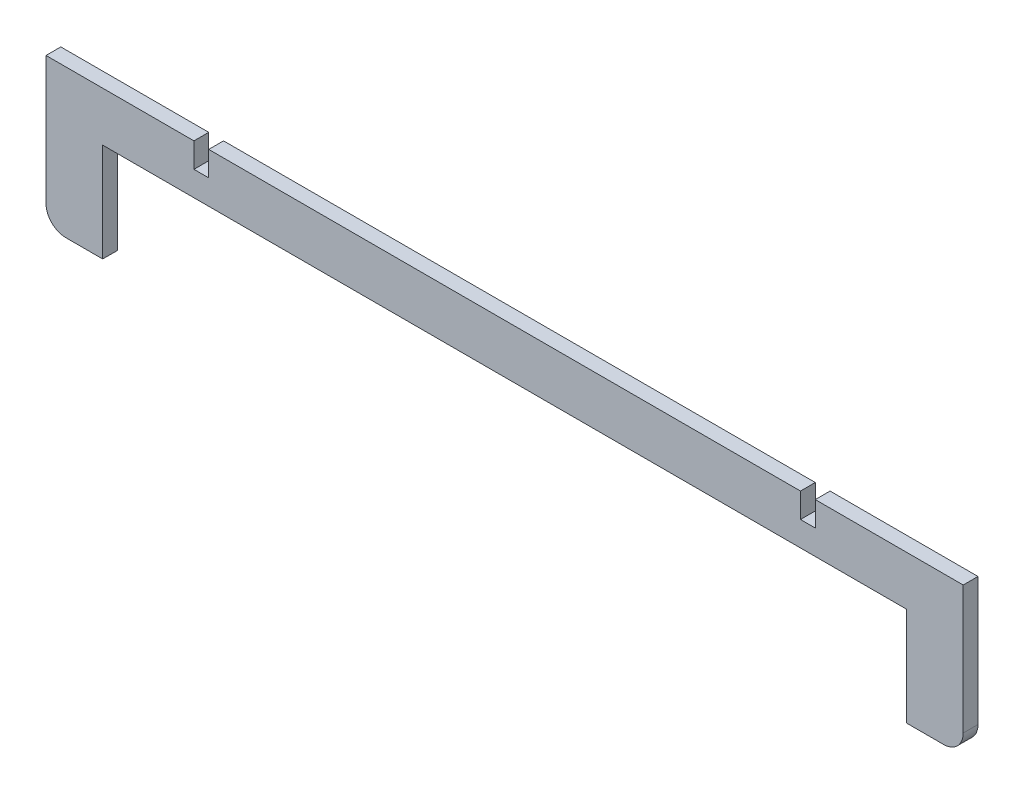
ISO-10303-21;
HEADER;
FILE_DESCRIPTION(('STEP AP214'),'2;1');
FILE_NAME('part.step','',(''),(''),'','','');
FILE_SCHEMA(('AUTOMOTIVE_DESIGN { 1 0 10303 214 1 1 1 1 }'));
ENDSEC;
DATA;
#1=APPLICATION_CONTEXT('core data for automotive mechanical design processes');
#2=APPLICATION_PROTOCOL_DEFINITION('international standard','automotive_design',2000,#1);
#3=PRODUCT_CONTEXT('',#1,'mechanical');
#4=PRODUCT('Part','Part','',(#3));
#5=PRODUCT_RELATED_PRODUCT_CATEGORY('part','',(#4));
#6=PRODUCT_DEFINITION_FORMATION('','',#4);
#7=PRODUCT_DEFINITION_CONTEXT('part definition',#1,'design');
#8=PRODUCT_DEFINITION('design','',#6,#7);
#9=PRODUCT_DEFINITION_SHAPE('','',#8);
#10=(LENGTH_UNIT() NAMED_UNIT(*) SI_UNIT(.MILLI.,.METRE.));
#11=(NAMED_UNIT(*) PLANE_ANGLE_UNIT() SI_UNIT($,.RADIAN.));
#12=(NAMED_UNIT(*) SI_UNIT($,.STERADIAN.) SOLID_ANGLE_UNIT());
#13=UNCERTAINTY_MEASURE_WITH_UNIT(LENGTH_MEASURE(1.E-05),#10,'distance_accuracy_value','');
#14=(GEOMETRIC_REPRESENTATION_CONTEXT(3) GLOBAL_UNCERTAINTY_ASSIGNED_CONTEXT((#13)) GLOBAL_UNIT_ASSIGNED_CONTEXT((#10,
#11,#12)) REPRESENTATION_CONTEXT('',''));
#15=CARTESIAN_POINT('',(0.,0.,0.));
#16=DIRECTION('',(0.,0.,1.));
#17=DIRECTION('',(1.,0.,0.));
#18=AXIS2_PLACEMENT_3D('',#15,#16,#17);
#19=CARTESIAN_POINT('',(-93.,-15.,3.));
#20=DIRECTION('',(0.,1.,0.));
#21=DIRECTION('',(0.,0.,1.));
#22=AXIS2_PLACEMENT_3D('',#19,#20,#21);
#23=PLANE('',#22);
#24=DIRECTION('',(1.,0.,0.));
#25=VECTOR('',#24,1.);
#26=CARTESIAN_POINT('',(-93.,-15.,0.));
#27=LINE('',#26,#25);
#28=CARTESIAN_POINT('',(81.5,-15.,0.));
#29=VERTEX_POINT('',#28);
#30=CARTESIAN_POINT('',(89.,-15.,0.));
#31=VERTEX_POINT('',#30);
#32=EDGE_CURVE('E192',#29,#31,#27,.T.);
#33=ORIENTED_EDGE('',*,*,#32,.T.);
#34=DIRECTION('',(0.,0.,-1.));
#35=VECTOR('',#34,1.);
#36=CARTESIAN_POINT('',(89.,-15.,3.));
#37=LINE('',#36,#35);
#38=CARTESIAN_POINT('',(89.,-15.,3.));
#39=VERTEX_POINT('',#38);
#40=EDGE_CURVE('E212',#31,#39,#37,.F.);
#41=ORIENTED_EDGE('',*,*,#40,.T.);
#42=DIRECTION('',(1.,0.,0.));
#43=VECTOR('',#42,1.);
#44=CARTESIAN_POINT('',(-93.,-15.,3.));
#45=LINE('',#44,#43);
#46=CARTESIAN_POINT('',(81.5,-15.,3.));
#47=VERTEX_POINT('',#46);
#48=EDGE_CURVE('E391',#47,#39,#45,.T.);
#49=ORIENTED_EDGE('',*,*,#48,.F.);
#50=DIRECTION('',(0.,0.,-1.));
#51=VECTOR('',#50,1.);
#52=CARTESIAN_POINT('',(81.5,-15.,3.));
#53=LINE('',#52,#51);
#54=EDGE_CURVE('E384',#47,#29,#53,.T.);
#55=ORIENTED_EDGE('',*,*,#54,.T.);
#56=EDGE_LOOP('',(#33,#41,#49,#55));
#57=FACE_BOUND('',#56,.T.);
#58=ADVANCED_FACE('F39',(#57),#23,.F.);
#59=CARTESIAN_POINT('',(93.,15.,3.));
#60=DIRECTION('',(-1.,0.,0.));
#61=DIRECTION('',(0.,0.,1.));
#62=AXIS2_PLACEMENT_3D('',#59,#60,#61);
#63=PLANE('',#62);
#64=DIRECTION('',(0.,1.,0.));
#65=VECTOR('',#64,1.);
#66=CARTESIAN_POINT('',(93.,15.,3.));
#67=LINE('',#66,#65);
#68=CARTESIAN_POINT('',(93.,-11.,3.));
#69=VERTEX_POINT('',#68);
#70=CARTESIAN_POINT('',(93.,15.,3.));
#71=VERTEX_POINT('',#70);
#72=EDGE_CURVE('E232',#69,#71,#67,.T.);
#73=ORIENTED_EDGE('',*,*,#72,.F.);
#74=DIRECTION('',(0.,0.,-1.));
#75=VECTOR('',#74,1.);
#76=CARTESIAN_POINT('',(93.,-11.,3.));
#77=LINE('',#76,#75);
#78=CARTESIAN_POINT('',(93.,-11.,0.));
#79=VERTEX_POINT('',#78);
#80=EDGE_CURVE('E194',#69,#79,#77,.T.);
#81=ORIENTED_EDGE('',*,*,#80,.T.);
#82=DIRECTION('',(0.,1.,0.));
#83=VECTOR('',#82,1.);
#84=CARTESIAN_POINT('',(93.,15.,0.));
#85=LINE('',#84,#83);
#86=CARTESIAN_POINT('',(93.,15.,0.));
#87=VERTEX_POINT('',#86);
#88=EDGE_CURVE('E296',#79,#87,#85,.T.);
#89=ORIENTED_EDGE('',*,*,#88,.T.);
#90=DIRECTION('',(0.,0.,-1.));
#91=VECTOR('',#90,1.);
#92=CARTESIAN_POINT('',(93.,15.,3.));
#93=LINE('',#92,#91);
#94=EDGE_CURVE('E195',#71,#87,#93,.T.);
#95=ORIENTED_EDGE('',*,*,#94,.F.);
#96=EDGE_LOOP('',(#73,#81,#89,#95));
#97=FACE_BOUND('',#96,.T.);
#98=ADVANCED_FACE('F327',(#97),#63,.F.);
#99=CARTESIAN_POINT('',(63.,15.,3.));
#100=DIRECTION('',(0.,-1.,0.));
#101=DIRECTION('',(0.,0.,-1.));
#102=AXIS2_PLACEMENT_3D('',#99,#100,#101);
#103=PLANE('',#102);
#104=DIRECTION('',(-1.,0.,0.));
#105=VECTOR('',#104,1.);
#106=CARTESIAN_POINT('',(63.,15.,0.));
#107=LINE('',#106,#105);
#108=CARTESIAN_POINT('',(63.,15.,0.));
#109=VERTEX_POINT('',#108);
#110=EDGE_CURVE('E287',#87,#109,#107,.T.);
#111=ORIENTED_EDGE('',*,*,#110,.T.);
#112=DIRECTION('',(0.,0.,-1.));
#113=VECTOR('',#112,1.);
#114=CARTESIAN_POINT('',(63.,15.,3.));
#115=LINE('',#114,#113);
#116=CARTESIAN_POINT('',(63.,15.,3.));
#117=VERTEX_POINT('',#116);
#118=EDGE_CURVE('E203',#117,#109,#115,.T.);
#119=ORIENTED_EDGE('',*,*,#118,.F.);
#120=DIRECTION('',(-1.,0.,0.));
#121=VECTOR('',#120,1.);
#122=CARTESIAN_POINT('',(63.,15.,3.));
#123=LINE('',#122,#121);
#124=EDGE_CURVE('E236',#71,#117,#123,.T.);
#125=ORIENTED_EDGE('',*,*,#124,.F.);
#126=ORIENTED_EDGE('',*,*,#94,.T.);
#127=EDGE_LOOP('',(#111,#119,#125,#126));
#128=FACE_BOUND('',#127,.T.);
#129=ADVANCED_FACE('F333',(#128),#103,.F.);
#130=CARTESIAN_POINT('',(63.,10.,3.));
#131=DIRECTION('',(1.,0.,0.));
#132=DIRECTION('',(0.,0.,-1.));
#133=AXIS2_PLACEMENT_3D('',#130,#131,#132);
#134=PLANE('',#133);
#135=DIRECTION('',(0.,-1.,0.));
#136=VECTOR('',#135,1.);
#137=CARTESIAN_POINT('',(63.,10.,0.));
#138=LINE('',#137,#136);
#139=CARTESIAN_POINT('',(63.,10.,0.));
#140=VERTEX_POINT('',#139);
#141=EDGE_CURVE('E281',#109,#140,#138,.T.);
#142=ORIENTED_EDGE('',*,*,#141,.T.);
#143=DIRECTION('',(0.,0.,-1.));
#144=VECTOR('',#143,1.);
#145=CARTESIAN_POINT('',(63.,10.,3.));
#146=LINE('',#145,#144);
#147=CARTESIAN_POINT('',(63.,10.,3.));
#148=VERTEX_POINT('',#147);
#149=EDGE_CURVE('E270',#148,#140,#146,.T.);
#150=ORIENTED_EDGE('',*,*,#149,.F.);
#151=DIRECTION('',(0.,-1.,0.));
#152=VECTOR('',#151,1.);
#153=CARTESIAN_POINT('',(63.,10.,3.));
#154=LINE('',#153,#152);
#155=EDGE_CURVE('E282',#117,#148,#154,.T.);
#156=ORIENTED_EDGE('',*,*,#155,.F.);
#157=ORIENTED_EDGE('',*,*,#118,.T.);
#158=EDGE_LOOP('',(#142,#150,#156,#157));
#159=FACE_BOUND('',#158,.T.);
#160=ADVANCED_FACE('F279',(#159),#134,.F.);
#161=CARTESIAN_POINT('',(60.,10.,3.));
#162=DIRECTION('',(0.,-1.,0.));
#163=DIRECTION('',(0.,0.,-1.));
#164=AXIS2_PLACEMENT_3D('',#161,#162,#163);
#165=PLANE('',#164);
#166=DIRECTION('',(-1.,0.,0.));
#167=VECTOR('',#166,1.);
#168=CARTESIAN_POINT('',(60.,10.,0.));
#169=LINE('',#168,#167);
#170=CARTESIAN_POINT('',(60.,10.,0.));
#171=VERTEX_POINT('',#170);
#172=EDGE_CURVE('E289',#140,#171,#169,.T.);
#173=ORIENTED_EDGE('',*,*,#172,.T.);
#174=DIRECTION('',(0.,0.,-1.));
#175=VECTOR('',#174,1.);
#176=CARTESIAN_POINT('',(60.,10.,3.));
#177=LINE('',#176,#175);
#178=CARTESIAN_POINT('',(60.,10.,3.));
#179=VERTEX_POINT('',#178);
#180=EDGE_CURVE('E266',#179,#171,#177,.T.);
#181=ORIENTED_EDGE('',*,*,#180,.F.);
#182=DIRECTION('',(-1.,0.,0.));
#183=VECTOR('',#182,1.);
#184=CARTESIAN_POINT('',(60.,10.,3.));
#185=LINE('',#184,#183);
#186=EDGE_CURVE('E413',#148,#179,#185,.T.);
#187=ORIENTED_EDGE('',*,*,#186,.F.);
#188=ORIENTED_EDGE('',*,*,#149,.T.);
#189=EDGE_LOOP('',(#173,#181,#187,#188));
#190=FACE_BOUND('',#189,.T.);
#191=ADVANCED_FACE('F370',(#190),#165,.F.);
#192=CARTESIAN_POINT('',(60.,10.,3.));
#193=DIRECTION('',(-1.,0.,0.));
#194=DIRECTION('',(0.,0.,1.));
#195=AXIS2_PLACEMENT_3D('',#192,#193,#194);
#196=PLANE('',#195);
#197=DIRECTION('',(0.,1.,0.));
#198=VECTOR('',#197,1.);
#199=CARTESIAN_POINT('',(60.,10.,0.));
#200=LINE('',#199,#198);
#201=CARTESIAN_POINT('',(60.,15.,0.));
#202=VERTEX_POINT('',#201);
#203=EDGE_CURVE('E294',#171,#202,#200,.T.);
#204=ORIENTED_EDGE('',*,*,#203,.T.);
#205=DIRECTION('',(0.,0.,-1.));
#206=VECTOR('',#205,1.);
#207=CARTESIAN_POINT('',(60.,15.,3.));
#208=LINE('',#207,#206);
#209=CARTESIAN_POINT('',(60.,15.,3.));
#210=VERTEX_POINT('',#209);
#211=EDGE_CURVE('E262',#210,#202,#208,.T.);
#212=ORIENTED_EDGE('',*,*,#211,.F.);
#213=DIRECTION('',(0.,1.,0.));
#214=VECTOR('',#213,1.);
#215=CARTESIAN_POINT('',(60.,10.,3.));
#216=LINE('',#215,#214);
#217=EDGE_CURVE('E410',#179,#210,#216,.T.);
#218=ORIENTED_EDGE('',*,*,#217,.F.);
#219=ORIENTED_EDGE('',*,*,#180,.T.);
#220=EDGE_LOOP('',(#204,#212,#218,#219));
#221=FACE_BOUND('',#220,.T.);
#222=ADVANCED_FACE('F366',(#221),#196,.F.);
#223=CARTESIAN_POINT('',(-60.,15.,3.));
#224=DIRECTION('',(0.,-1.,0.));
#225=DIRECTION('',(0.,0.,-1.));
#226=AXIS2_PLACEMENT_3D('',#223,#224,#225);
#227=PLANE('',#226);
#228=DIRECTION('',(-1.,0.,0.));
#229=VECTOR('',#228,1.);
#230=CARTESIAN_POINT('',(-60.,15.,0.));
#231=LINE('',#230,#229);
#232=CARTESIAN_POINT('',(-60.,15.,0.));
#233=VERTEX_POINT('',#232);
#234=EDGE_CURVE('E302',#202,#233,#231,.T.);
#235=ORIENTED_EDGE('',*,*,#234,.T.);
#236=DIRECTION('',(0.,0.,-1.));
#237=VECTOR('',#236,1.);
#238=CARTESIAN_POINT('',(-60.,15.,3.));
#239=LINE('',#238,#237);
#240=CARTESIAN_POINT('',(-60.,15.,3.));
#241=VERTEX_POINT('',#240);
#242=EDGE_CURVE('E258',#241,#233,#239,.T.);
#243=ORIENTED_EDGE('',*,*,#242,.F.);
#244=DIRECTION('',(-1.,0.,0.));
#245=VECTOR('',#244,1.);
#246=CARTESIAN_POINT('',(-60.,15.,3.));
#247=LINE('',#246,#245);
#248=EDGE_CURVE('E407',#210,#241,#247,.T.);
#249=ORIENTED_EDGE('',*,*,#248,.F.);
#250=ORIENTED_EDGE('',*,*,#211,.T.);
#251=EDGE_LOOP('',(#235,#243,#249,#250));
#252=FACE_BOUND('',#251,.T.);
#253=ADVANCED_FACE('F362',(#252),#227,.F.);
#254=CARTESIAN_POINT('',(-60.,10.,3.));
#255=DIRECTION('',(1.,0.,0.));
#256=DIRECTION('',(0.,0.,-1.));
#257=AXIS2_PLACEMENT_3D('',#254,#255,#256);
#258=PLANE('',#257);
#259=DIRECTION('',(0.,-1.,0.));
#260=VECTOR('',#259,1.);
#261=CARTESIAN_POINT('',(-60.,10.,0.));
#262=LINE('',#261,#260);
#263=CARTESIAN_POINT('',(-60.,10.,0.));
#264=VERTEX_POINT('',#263);
#265=EDGE_CURVE('E305',#233,#264,#262,.T.);
#266=ORIENTED_EDGE('',*,*,#265,.T.);
#267=DIRECTION('',(0.,0.,-1.));
#268=VECTOR('',#267,1.);
#269=CARTESIAN_POINT('',(-60.,10.,3.));
#270=LINE('',#269,#268);
#271=CARTESIAN_POINT('',(-60.,10.,3.));
#272=VERTEX_POINT('',#271);
#273=EDGE_CURVE('E254',#272,#264,#270,.T.);
#274=ORIENTED_EDGE('',*,*,#273,.F.);
#275=DIRECTION('',(0.,-1.,0.));
#276=VECTOR('',#275,1.);
#277=CARTESIAN_POINT('',(-60.,10.,3.));
#278=LINE('',#277,#276);
#279=EDGE_CURVE('E404',#241,#272,#278,.T.);
#280=ORIENTED_EDGE('',*,*,#279,.F.);
#281=ORIENTED_EDGE('',*,*,#242,.T.);
#282=EDGE_LOOP('',(#266,#274,#280,#281));
#283=FACE_BOUND('',#282,.T.);
#284=ADVANCED_FACE('F358',(#283),#258,.F.);
#285=CARTESIAN_POINT('',(-60.,10.,3.));
#286=DIRECTION('',(0.,-1.,0.));
#287=DIRECTION('',(1.,0.,0.));
#288=AXIS2_PLACEMENT_3D('',#285,#286,#287);
#289=PLANE('',#288);
#290=DIRECTION('',(-1.,0.,0.));
#291=VECTOR('',#290,1.);
#292=CARTESIAN_POINT('',(-60.,10.,0.));
#293=LINE('',#292,#291);
#294=CARTESIAN_POINT('',(-63.,10.,0.));
#295=VERTEX_POINT('',#294);
#296=EDGE_CURVE('E308',#264,#295,#293,.T.);
#297=ORIENTED_EDGE('',*,*,#296,.T.);
#298=DIRECTION('',(0.,0.,-1.));
#299=VECTOR('',#298,1.);
#300=CARTESIAN_POINT('',(-63.,10.,3.));
#301=LINE('',#300,#299);
#302=CARTESIAN_POINT('',(-63.,10.,3.));
#303=VERTEX_POINT('',#302);
#304=EDGE_CURVE('E250',#303,#295,#301,.T.);
#305=ORIENTED_EDGE('',*,*,#304,.F.);
#306=DIRECTION('',(-1.,0.,0.));
#307=VECTOR('',#306,1.);
#308=CARTESIAN_POINT('',(-60.,10.,3.));
#309=LINE('',#308,#307);
#310=EDGE_CURVE('E401',#272,#303,#309,.T.);
#311=ORIENTED_EDGE('',*,*,#310,.F.);
#312=ORIENTED_EDGE('',*,*,#273,.T.);
#313=EDGE_LOOP('',(#297,#305,#311,#312));
#314=FACE_BOUND('',#313,.T.);
#315=ADVANCED_FACE('F354',(#314),#289,.F.);
#316=CARTESIAN_POINT('',(-63.,10.,3.));
#317=DIRECTION('',(-1.,0.,0.));
#318=DIRECTION('',(0.,0.,1.));
#319=AXIS2_PLACEMENT_3D('',#316,#317,#318);
#320=PLANE('',#319);
#321=DIRECTION('',(0.,1.,0.));
#322=VECTOR('',#321,1.);
#323=CARTESIAN_POINT('',(-63.,10.,0.));
#324=LINE('',#323,#322);
#325=CARTESIAN_POINT('',(-63.,15.,0.));
#326=VERTEX_POINT('',#325);
#327=EDGE_CURVE('E311',#295,#326,#324,.T.);
#328=ORIENTED_EDGE('',*,*,#327,.T.);
#329=DIRECTION('',(0.,0.,-1.));
#330=VECTOR('',#329,1.);
#331=CARTESIAN_POINT('',(-63.,15.,3.));
#332=LINE('',#331,#330);
#333=CARTESIAN_POINT('',(-63.,15.,3.));
#334=VERTEX_POINT('',#333);
#335=EDGE_CURVE('E246',#334,#326,#332,.T.);
#336=ORIENTED_EDGE('',*,*,#335,.F.);
#337=DIRECTION('',(0.,1.,0.));
#338=VECTOR('',#337,1.);
#339=CARTESIAN_POINT('',(-63.,10.,3.));
#340=LINE('',#339,#338);
#341=EDGE_CURVE('E398',#303,#334,#340,.T.);
#342=ORIENTED_EDGE('',*,*,#341,.F.);
#343=ORIENTED_EDGE('',*,*,#304,.T.);
#344=EDGE_LOOP('',(#328,#336,#342,#343));
#345=FACE_BOUND('',#344,.T.);
#346=ADVANCED_FACE('F349',(#345),#320,.F.);
#347=CARTESIAN_POINT('',(-93.,15.,3.));
#348=DIRECTION('',(0.,-1.,0.));
#349=DIRECTION('',(0.,0.,-1.));
#350=AXIS2_PLACEMENT_3D('',#347,#348,#349);
#351=PLANE('',#350);
#352=DIRECTION('',(-1.,0.,0.));
#353=VECTOR('',#352,1.);
#354=CARTESIAN_POINT('',(-93.,15.,0.));
#355=LINE('',#354,#353);
#356=CARTESIAN_POINT('',(-93.,15.,0.));
#357=VERTEX_POINT('',#356);
#358=EDGE_CURVE('E313',#326,#357,#355,.T.);
#359=ORIENTED_EDGE('',*,*,#358,.T.);
#360=DIRECTION('',(0.,0.,-1.));
#361=VECTOR('',#360,1.);
#362=CARTESIAN_POINT('',(-93.,15.,3.));
#363=LINE('',#362,#361);
#364=CARTESIAN_POINT('',(-93.,15.,3.));
#365=VERTEX_POINT('',#364);
#366=EDGE_CURVE('E242',#365,#357,#363,.T.);
#367=ORIENTED_EDGE('',*,*,#366,.F.);
#368=DIRECTION('',(-1.,0.,0.));
#369=VECTOR('',#368,1.);
#370=CARTESIAN_POINT('',(-93.,15.,3.));
#371=LINE('',#370,#369);
#372=EDGE_CURVE('E395',#334,#365,#371,.T.);
#373=ORIENTED_EDGE('',*,*,#372,.F.);
#374=ORIENTED_EDGE('',*,*,#335,.T.);
#375=EDGE_LOOP('',(#359,#367,#373,#374));
#376=FACE_BOUND('',#375,.T.);
#377=ADVANCED_FACE('F345',(#376),#351,.F.);
#378=CARTESIAN_POINT('',(-93.,15.,3.));
#379=DIRECTION('',(1.,0.,0.));
#380=DIRECTION('',(0.,0.,-1.));
#381=AXIS2_PLACEMENT_3D('',#378,#379,#380);
#382=PLANE('',#381);
#383=DIRECTION('',(0.,-1.,0.));
#384=VECTOR('',#383,1.);
#385=CARTESIAN_POINT('',(-93.,15.,0.));
#386=LINE('',#385,#384);
#387=CARTESIAN_POINT('',(-93.,-11.,0.));
#388=VERTEX_POINT('',#387);
#389=EDGE_CURVE('E238',#357,#388,#386,.T.);
#390=ORIENTED_EDGE('',*,*,#389,.T.);
#391=DIRECTION('',(0.,0.,-1.));
#392=VECTOR('',#391,1.);
#393=CARTESIAN_POINT('',(-93.,-11.,3.));
#394=LINE('',#393,#392);
#395=CARTESIAN_POINT('',(-93.,-11.,3.));
#396=VERTEX_POINT('',#395);
#397=EDGE_CURVE('E11',#388,#396,#394,.F.);
#398=ORIENTED_EDGE('',*,*,#397,.T.);
#399=DIRECTION('',(0.,-1.,0.));
#400=VECTOR('',#399,1.);
#401=CARTESIAN_POINT('',(-93.,15.,3.));
#402=LINE('',#401,#400);
#403=EDGE_CURVE('E392',#365,#396,#402,.T.);
#404=ORIENTED_EDGE('',*,*,#403,.F.);
#405=ORIENTED_EDGE('',*,*,#366,.T.);
#406=EDGE_LOOP('',(#390,#398,#404,#405));
#407=FACE_BOUND('',#406,.T.);
#408=ADVANCED_FACE('F319',(#407),#382,.F.);
#409=CARTESIAN_POINT('',(-89.,-15.,3.));
#410=VERTEX_POINT('',#409);
#411=CARTESIAN_POINT('',(-81.5,-15.,3.));
#412=VERTEX_POINT('',#411);
#413=EDGE_CURVE('E228',#410,#412,#45,.T.);
#414=ORIENTED_EDGE('',*,*,#413,.F.);
#415=DIRECTION('',(0.,0.,-1.));
#416=VECTOR('',#415,1.);
#417=CARTESIAN_POINT('',(-89.,-15.,3.));
#418=LINE('',#417,#416);
#419=CARTESIAN_POINT('',(-89.,-15.,0.));
#420=VERTEX_POINT('',#419);
#421=EDGE_CURVE('E48',#410,#420,#418,.T.);
#422=ORIENTED_EDGE('',*,*,#421,.T.);
#423=CARTESIAN_POINT('',(-81.5,-15.,0.));
#424=VERTEX_POINT('',#423);
#425=EDGE_CURVE('E226',#420,#424,#27,.T.);
#426=ORIENTED_EDGE('',*,*,#425,.T.);
#427=DIRECTION('',(0.,0.,1.));
#428=VECTOR('',#427,1.);
#429=CARTESIAN_POINT('',(-81.5,-15.,3.));
#430=LINE('',#429,#428);
#431=EDGE_CURVE('E386',#424,#412,#430,.T.);
#432=ORIENTED_EDGE('',*,*,#431,.T.);
#433=EDGE_LOOP('',(#414,#422,#426,#432));
#434=FACE_BOUND('',#433,.T.);
#435=ADVANCED_FACE('F224',(#434),#23,.F.);
#436=CARTESIAN_POINT('',(0.,0.,3.));
#437=DIRECTION('',(0.,0.,1.));
#438=DIRECTION('',(1.,0.,0.));
#439=AXIS2_PLACEMENT_3D('',#436,#437,#438);
#440=PLANE('',#439);
#441=ORIENTED_EDGE('',*,*,#48,.T.);
#442=CARTESIAN_POINT('',(89.,-11.,3.));
#443=DIRECTION('',(0.,0.,1.));
#444=DIRECTION('',(1.,0.,0.));
#445=AXIS2_PLACEMENT_3D('',#442,#443,#444);
#446=CIRCLE('',#445,4.);
#447=EDGE_CURVE('E217',#39,#69,#446,.T.);
#448=ORIENTED_EDGE('',*,*,#447,.T.);
#449=ORIENTED_EDGE('',*,*,#72,.T.);
#450=ORIENTED_EDGE('',*,*,#124,.T.);
#451=ORIENTED_EDGE('',*,*,#155,.T.);
#452=ORIENTED_EDGE('',*,*,#186,.T.);
#453=ORIENTED_EDGE('',*,*,#217,.T.);
#454=ORIENTED_EDGE('',*,*,#248,.T.);
#455=ORIENTED_EDGE('',*,*,#279,.T.);
#456=ORIENTED_EDGE('',*,*,#310,.T.);
#457=ORIENTED_EDGE('',*,*,#341,.T.);
#458=ORIENTED_EDGE('',*,*,#372,.T.);
#459=ORIENTED_EDGE('',*,*,#403,.T.);
#460=CARTESIAN_POINT('',(-89.,-11.,3.));
#461=DIRECTION('',(0.,0.,1.));
#462=DIRECTION('',(1.,0.,0.));
#463=AXIS2_PLACEMENT_3D('',#460,#461,#462);
#464=CIRCLE('',#463,4.);
#465=EDGE_CURVE('E55',#396,#410,#464,.T.);
#466=ORIENTED_EDGE('',*,*,#465,.T.);
#467=ORIENTED_EDGE('',*,*,#413,.T.);
#468=DIRECTION('',(0.,-1.,0.));
#469=VECTOR('',#468,1.);
#470=CARTESIAN_POINT('',(-81.5,5.,3.));
#471=LINE('',#470,#469);
#472=CARTESIAN_POINT('',(-81.5,5.,3.));
#473=VERTEX_POINT('',#472);
#474=EDGE_CURVE('E186',#473,#412,#471,.T.);
#475=ORIENTED_EDGE('',*,*,#474,.F.);
#476=DIRECTION('',(-1.,0.,0.));
#477=VECTOR('',#476,1.);
#478=CARTESIAN_POINT('',(-81.5,5.,3.));
#479=LINE('',#478,#477);
#480=CARTESIAN_POINT('',(81.5,5.,3.));
#481=VERTEX_POINT('',#480);
#482=EDGE_CURVE('E427',#481,#473,#479,.T.);
#483=ORIENTED_EDGE('',*,*,#482,.F.);
#484=DIRECTION('',(0.,1.,0.));
#485=VECTOR('',#484,1.);
#486=CARTESIAN_POINT('',(81.5,5.,3.));
#487=LINE('',#486,#485);
#488=EDGE_CURVE('E171',#47,#481,#487,.T.);
#489=ORIENTED_EDGE('',*,*,#488,.F.);
#490=EDGE_LOOP('',(#441,#448,#449,#450,#451,#452,#453,#454,#455,#456,#457,#458,#459,#466,#467,
#475,#483,#489));
#491=FACE_BOUND('',#490,.T.);
#492=ADVANCED_FACE('F339',(#491),#440,.T.);
#493=CARTESIAN_POINT('',(0.,0.,0.));
#494=DIRECTION('',(0.,0.,1.));
#495=DIRECTION('',(1.,0.,0.));
#496=AXIS2_PLACEMENT_3D('',#493,#494,#495);
#497=PLANE('',#496);
#498=ORIENTED_EDGE('',*,*,#88,.F.);
#499=CARTESIAN_POINT('',(89.,-11.,0.));
#500=DIRECTION('',(0.,0.,1.));
#501=DIRECTION('',(1.,0.,0.));
#502=AXIS2_PLACEMENT_3D('',#499,#500,#501);
#503=CIRCLE('',#502,4.);
#504=EDGE_CURVE('E209',#79,#31,#503,.F.);
#505=ORIENTED_EDGE('',*,*,#504,.T.);
#506=ORIENTED_EDGE('',*,*,#32,.F.);
#507=DIRECTION('',(0.,1.,0.));
#508=VECTOR('',#507,1.);
#509=CARTESIAN_POINT('',(81.5,0.,0.));
#510=LINE('',#509,#508);
#511=CARTESIAN_POINT('',(81.5,5.,0.));
#512=VERTEX_POINT('',#511);
#513=EDGE_CURVE('E168',#29,#512,#510,.T.);
#514=ORIENTED_EDGE('',*,*,#513,.T.);
#515=DIRECTION('',(-1.,0.,0.));
#516=VECTOR('',#515,1.);
#517=CARTESIAN_POINT('',(-81.5,5.,0.));
#518=LINE('',#517,#516);
#519=CARTESIAN_POINT('',(-81.5,5.,0.));
#520=VERTEX_POINT('',#519);
#521=EDGE_CURVE('E181',#512,#520,#518,.T.);
#522=ORIENTED_EDGE('',*,*,#521,.T.);
#523=DIRECTION('',(0.,-1.,0.));
#524=VECTOR('',#523,1.);
#525=CARTESIAN_POINT('',(-81.5,5.,0.));
#526=LINE('',#525,#524);
#527=EDGE_CURVE('E177',#520,#424,#526,.T.);
#528=ORIENTED_EDGE('',*,*,#527,.T.);
#529=ORIENTED_EDGE('',*,*,#425,.F.);
#530=CARTESIAN_POINT('',(-89.,-11.,0.));
#531=DIRECTION('',(0.,0.,1.));
#532=DIRECTION('',(1.,0.,0.));
#533=AXIS2_PLACEMENT_3D('',#530,#531,#532);
#534=CIRCLE('',#533,4.);
#535=EDGE_CURVE('E200',#420,#388,#534,.F.);
#536=ORIENTED_EDGE('',*,*,#535,.T.);
#537=ORIENTED_EDGE('',*,*,#389,.F.);
#538=ORIENTED_EDGE('',*,*,#358,.F.);
#539=ORIENTED_EDGE('',*,*,#327,.F.);
#540=ORIENTED_EDGE('',*,*,#296,.F.);
#541=ORIENTED_EDGE('',*,*,#265,.F.);
#542=ORIENTED_EDGE('',*,*,#234,.F.);
#543=ORIENTED_EDGE('',*,*,#203,.F.);
#544=ORIENTED_EDGE('',*,*,#172,.F.);
#545=ORIENTED_EDGE('',*,*,#141,.F.);
#546=ORIENTED_EDGE('',*,*,#110,.F.);
#547=EDGE_LOOP('',(#498,#505,#506,#514,#522,#528,#529,#536,#537,#538,#539,#540,#541,#542,#543,
#544,#545,#546));
#548=FACE_BOUND('',#547,.T.);
#549=ADVANCED_FACE('F190',(#548),#497,.F.);
#550=CARTESIAN_POINT('',(81.5,5.,0.));
#551=DIRECTION('',(1.,0.,0.));
#552=DIRECTION('',(0.,0.,-1.));
#553=AXIS2_PLACEMENT_3D('',#550,#551,#552);
#554=PLANE('',#553);
#555=ORIENTED_EDGE('',*,*,#488,.T.);
#556=DIRECTION('',(0.,0.,1.));
#557=VECTOR('',#556,1.);
#558=CARTESIAN_POINT('',(81.5,5.,0.));
#559=LINE('',#558,#557);
#560=EDGE_CURVE('E164',#512,#481,#559,.T.);
#561=ORIENTED_EDGE('',*,*,#560,.F.);
#562=ORIENTED_EDGE('',*,*,#513,.F.);
#563=ORIENTED_EDGE('',*,*,#54,.F.);
#564=EDGE_LOOP('',(#555,#561,#562,#563));
#565=FACE_BOUND('',#564,.T.);
#566=ADVANCED_FACE('F166',(#565),#554,.F.);
#567=CARTESIAN_POINT('',(-81.5,5.,0.));
#568=DIRECTION('',(-1.,0.,0.));
#569=DIRECTION('',(0.,0.,1.));
#570=AXIS2_PLACEMENT_3D('',#567,#568,#569);
#571=PLANE('',#570);
#572=ORIENTED_EDGE('',*,*,#527,.F.);
#573=DIRECTION('',(0.,0.,1.));
#574=VECTOR('',#573,1.);
#575=CARTESIAN_POINT('',(-81.5,5.,0.));
#576=LINE('',#575,#574);
#577=EDGE_CURVE('E176',#520,#473,#576,.T.);
#578=ORIENTED_EDGE('',*,*,#577,.T.);
#579=ORIENTED_EDGE('',*,*,#474,.T.);
#580=ORIENTED_EDGE('',*,*,#431,.F.);
#581=EDGE_LOOP('',(#572,#578,#579,#580));
#582=FACE_BOUND('',#581,.T.);
#583=ADVANCED_FACE('F436',(#582),#571,.F.);
#584=CARTESIAN_POINT('',(-81.5,5.,0.));
#585=DIRECTION('',(0.,1.,0.));
#586=DIRECTION('',(0.,0.,1.));
#587=AXIS2_PLACEMENT_3D('',#584,#585,#586);
#588=PLANE('',#587);
#589=ORIENTED_EDGE('',*,*,#482,.T.);
#590=ORIENTED_EDGE('',*,*,#577,.F.);
#591=ORIENTED_EDGE('',*,*,#521,.F.);
#592=ORIENTED_EDGE('',*,*,#560,.T.);
#593=EDGE_LOOP('',(#589,#590,#591,#592));
#594=FACE_BOUND('',#593,.T.);
#595=ADVANCED_FACE('F182',(#594),#588,.F.);
#596=CARTESIAN_POINT('',(89.,-11.,3.));
#597=DIRECTION('',(0.,0.,-1.));
#598=DIRECTION('',(-1.,0.,0.));
#599=AXIS2_PLACEMENT_3D('',#596,#597,#598);
#600=CYLINDRICAL_SURFACE('',#599,4.);
#601=ORIENTED_EDGE('',*,*,#447,.F.);
#602=ORIENTED_EDGE('',*,*,#40,.F.);
#603=ORIENTED_EDGE('',*,*,#504,.F.);
#604=ORIENTED_EDGE('',*,*,#80,.F.);
#605=EDGE_LOOP('',(#601,#602,#603,#604));
#606=FACE_BOUND('',#605,.T.);
#607=ADVANCED_FACE('F321',(#606),#600,.T.);
#608=CARTESIAN_POINT('',(-89.,-11.,3.));
#609=DIRECTION('',(0.,0.,-1.));
#610=DIRECTION('',(-1.,0.,0.));
#611=AXIS2_PLACEMENT_3D('',#608,#609,#610);
#612=CYLINDRICAL_SURFACE('',#611,4.);
#613=ORIENTED_EDGE('',*,*,#465,.F.);
#614=ORIENTED_EDGE('',*,*,#397,.F.);
#615=ORIENTED_EDGE('',*,*,#535,.F.);
#616=ORIENTED_EDGE('',*,*,#421,.F.);
#617=EDGE_LOOP('',(#613,#614,#615,#616));
#618=FACE_BOUND('',#617,.T.);
#619=ADVANCED_FACE('F41',(#618),#612,.T.);
#620=CLOSED_SHELL('',(#58,#98,#129,#160,#191,#222,#253,#284,#315,#346,#377,#408,#435,#492,#549,
#566,#583,#595,#607,#619));
#621=MANIFOLD_SOLID_BREP('B2',#620);
#622=ADVANCED_BREP_SHAPE_REPRESENTATION('',(#18,#621),#14);
#623=SHAPE_DEFINITION_REPRESENTATION(#9,#622);
ENDSEC;
END-ISO-10303-21;
